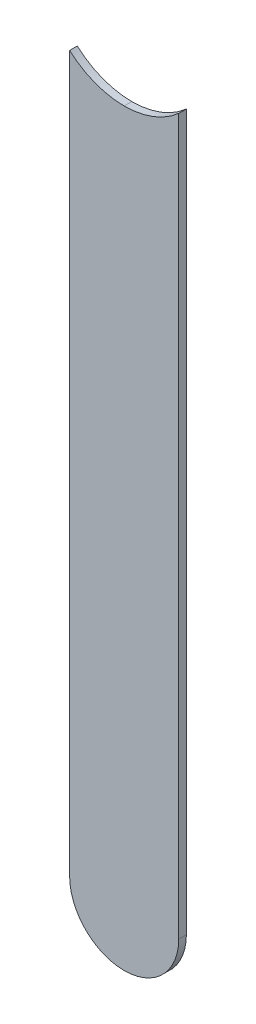
ISO-10303-21;
HEADER;
FILE_DESCRIPTION(('STEP AP214'),'2;1');
FILE_NAME('part.step','',(''),(''),'','','');
FILE_SCHEMA(('AUTOMOTIVE_DESIGN { 1 0 10303 214 1 1 1 1 }'));
ENDSEC;
DATA;
#1=APPLICATION_CONTEXT('core data for automotive mechanical design processes');
#2=APPLICATION_PROTOCOL_DEFINITION('international standard','automotive_design',2000,#1);
#3=PRODUCT_CONTEXT('',#1,'mechanical');
#4=PRODUCT('Part','Part','',(#3));
#5=PRODUCT_RELATED_PRODUCT_CATEGORY('part','',(#4));
#6=PRODUCT_DEFINITION_FORMATION('','',#4);
#7=PRODUCT_DEFINITION_CONTEXT('part definition',#1,'design');
#8=PRODUCT_DEFINITION('design','',#6,#7);
#9=PRODUCT_DEFINITION_SHAPE('','',#8);
#10=(LENGTH_UNIT() NAMED_UNIT(*) SI_UNIT(.MILLI.,.METRE.));
#11=(NAMED_UNIT(*) PLANE_ANGLE_UNIT() SI_UNIT($,.RADIAN.));
#12=(NAMED_UNIT(*) SI_UNIT($,.STERADIAN.) SOLID_ANGLE_UNIT());
#13=UNCERTAINTY_MEASURE_WITH_UNIT(LENGTH_MEASURE(1.E-05),#10,'distance_accuracy_value','');
#14=(GEOMETRIC_REPRESENTATION_CONTEXT(3) GLOBAL_UNCERTAINTY_ASSIGNED_CONTEXT((#13)) GLOBAL_UNIT_ASSIGNED_CONTEXT((#10,
#11,#12)) REPRESENTATION_CONTEXT('',''));
#15=CARTESIAN_POINT('',(0.,0.,0.));
#16=DIRECTION('',(0.,0.,1.));
#17=DIRECTION('',(1.,0.,0.));
#18=AXIS2_PLACEMENT_3D('',#15,#16,#17);
#19=CARTESIAN_POINT('',(157.73,-107.188,-0.035));
#20=DIRECTION('',(-1.,0.,0.));
#21=DIRECTION('',(0.,0.,1.));
#22=AXIS2_PLACEMENT_3D('',#19,#20,#21);
#23=PLANE('',#22);
#24=DIRECTION('',(0.,0.,-1.));
#25=VECTOR('',#24,1.);
#26=CARTESIAN_POINT('',(157.73,-103.9115084971,-0.045));
#27=LINE('',#26,#25);
#28=CARTESIAN_POINT('',(157.73,-103.9115084971,0.));
#29=VERTEX_POINT('',#28);
#30=CARTESIAN_POINT('',(157.73,-103.9115084971,-0.035));
#31=VERTEX_POINT('',#30);
#32=EDGE_CURVE('E11',#29,#31,#27,.T.);
#33=ORIENTED_EDGE('',*,*,#32,.F.);
#34=DIRECTION('',(0.,1.,0.));
#35=VECTOR('',#34,1.);
#36=CARTESIAN_POINT('',(157.73,-107.188,0.));
#37=LINE('',#36,#35);
#38=CARTESIAN_POINT('',(157.73,-107.188,0.));
#39=VERTEX_POINT('',#38);
#40=EDGE_CURVE('E133',#39,#29,#37,.T.);
#41=ORIENTED_EDGE('',*,*,#40,.F.);
#42=DIRECTION('',(0.,0.,1.));
#43=VECTOR('',#42,1.);
#44=CARTESIAN_POINT('',(157.73,-107.188,-0.035));
#45=LINE('',#44,#43);
#46=CARTESIAN_POINT('',(157.73,-107.188,-0.035));
#47=VERTEX_POINT('',#46);
#48=EDGE_CURVE('E119',#47,#39,#45,.T.);
#49=ORIENTED_EDGE('',*,*,#48,.F.);
#50=DIRECTION('',(0.,1.,0.));
#51=VECTOR('',#50,1.);
#52=CARTESIAN_POINT('',(157.73,-107.188,-0.035));
#53=LINE('',#52,#51);
#54=EDGE_CURVE('E86',#47,#31,#53,.T.);
#55=ORIENTED_EDGE('',*,*,#54,.T.);
#56=EDGE_LOOP('',(#33,#41,#49,#55));
#57=FACE_BOUND('',#56,.T.);
#58=ADVANCED_FACE('F17',(#57),#23,.F.);
#59=CARTESIAN_POINT('',(157.48,-103.632,-0.045));
#60=DIRECTION('',(0.,0.,-1.));
#61=DIRECTION('',(0.,-1.,0.));
#62=AXIS2_PLACEMENT_3D('',#59,#60,#61);
#63=CYLINDRICAL_SURFACE('',#62,0.375);
#64=CARTESIAN_POINT('',(157.48,-103.632,-0.035));
#65=DIRECTION('',(0.,0.,-1.));
#66=DIRECTION('',(0.,-1.,0.));
#67=AXIS2_PLACEMENT_3D('',#64,#65,#66);
#68=CIRCLE('',#67,0.375);
#69=CARTESIAN_POINT('',(157.48,-104.007,-0.035));
#70=VERTEX_POINT('',#69);
#71=EDGE_CURVE('E101',#31,#70,#68,.T.);
#72=ORIENTED_EDGE('',*,*,#71,.T.);
#73=DIRECTION('',(0.,0.,1.));
#74=VECTOR('',#73,1.);
#75=CARTESIAN_POINT('',(157.48,-104.007,-0.045));
#76=LINE('',#75,#74);
#77=CARTESIAN_POINT('',(157.48,-104.007,0.));
#78=VERTEX_POINT('',#77);
#79=EDGE_CURVE('E26',#70,#78,#76,.T.);
#80=ORIENTED_EDGE('',*,*,#79,.T.);
#81=CARTESIAN_POINT('',(157.48,-103.632,0.));
#82=DIRECTION('',(0.,0.,-1.));
#83=DIRECTION('',(0.,-1.,0.));
#84=AXIS2_PLACEMENT_3D('',#81,#82,#83);
#85=CIRCLE('',#84,0.375);
#86=EDGE_CURVE('E130',#29,#78,#85,.T.);
#87=ORIENTED_EDGE('',*,*,#86,.F.);
#88=ORIENTED_EDGE('',*,*,#32,.T.);
#89=EDGE_LOOP('',(#72,#80,#87,#88));
#90=FACE_BOUND('',#89,.T.);
#91=ADVANCED_FACE('F19',(#90),#63,.F.);
#92=CARTESIAN_POINT('',(157.48,-103.632,-0.045));
#93=DIRECTION('',(0.,0.,-1.));
#94=DIRECTION('',(0.,-1.,0.));
#95=AXIS2_PLACEMENT_3D('',#92,#93,#94);
#96=CYLINDRICAL_SURFACE('',#95,0.375);
#97=ORIENTED_EDGE('',*,*,#79,.F.);
#98=CARTESIAN_POINT('',(157.48,-103.632,-0.035));
#99=DIRECTION('',(0.,0.,-1.));
#100=DIRECTION('',(0.,-1.,0.));
#101=AXIS2_PLACEMENT_3D('',#98,#99,#100);
#102=CIRCLE('',#101,0.375);
#103=CARTESIAN_POINT('',(157.23,-103.9115084971,-0.035));
#104=VERTEX_POINT('',#103);
#105=EDGE_CURVE('E91',#70,#104,#102,.T.);
#106=ORIENTED_EDGE('',*,*,#105,.T.);
#107=DIRECTION('',(0.,0.,-1.));
#108=VECTOR('',#107,1.);
#109=CARTESIAN_POINT('',(157.23,-103.9115084971,-0.045));
#110=LINE('',#109,#108);
#111=CARTESIAN_POINT('',(157.23,-103.9115084971,0.));
#112=VERTEX_POINT('',#111);
#113=EDGE_CURVE('E99',#112,#104,#110,.T.);
#114=ORIENTED_EDGE('',*,*,#113,.F.);
#115=CARTESIAN_POINT('',(157.48,-103.632,0.));
#116=DIRECTION('',(0.,0.,-1.));
#117=DIRECTION('',(0.,-1.,0.));
#118=AXIS2_PLACEMENT_3D('',#115,#116,#117);
#119=CIRCLE('',#118,0.375);
#120=EDGE_CURVE('E118',#78,#112,#119,.T.);
#121=ORIENTED_EDGE('',*,*,#120,.F.);
#122=EDGE_LOOP('',(#97,#106,#114,#121));
#123=FACE_BOUND('',#122,.T.);
#124=ADVANCED_FACE('F145',(#123),#96,.F.);
#125=CARTESIAN_POINT('',(157.23,-103.632,0.));
#126=DIRECTION('',(0.,0.,1.));
#127=DIRECTION('',(1.,0.,0.));
#128=AXIS2_PLACEMENT_3D('',#125,#126,#127);
#129=PLANE('',#128);
#130=ORIENTED_EDGE('',*,*,#120,.T.);
#131=DIRECTION('',(0.,-1.,0.));
#132=VECTOR('',#131,1.);
#133=CARTESIAN_POINT('',(157.23,-103.632,0.));
#134=LINE('',#133,#132);
#135=CARTESIAN_POINT('',(157.23,-107.188,0.));
#136=VERTEX_POINT('',#135);
#137=EDGE_CURVE('E108',#112,#136,#134,.T.);
#138=ORIENTED_EDGE('',*,*,#137,.T.);
#139=CARTESIAN_POINT('',(157.48,-107.188,0.));
#140=DIRECTION('',(0.,0.,1.));
#141=DIRECTION('',(-1.,0.,0.));
#142=AXIS2_PLACEMENT_3D('',#139,#140,#141);
#143=CIRCLE('',#142,0.25);
#144=EDGE_CURVE('E105',#136,#39,#143,.T.);
#145=ORIENTED_EDGE('',*,*,#144,.T.);
#146=ORIENTED_EDGE('',*,*,#40,.T.);
#147=ORIENTED_EDGE('',*,*,#86,.T.);
#148=EDGE_LOOP('',(#130,#138,#145,#146,#147));
#149=FACE_BOUND('',#148,.T.);
#150=ADVANCED_FACE('F142',(#149),#129,.T.);
#151=CARTESIAN_POINT('',(157.48,-107.188,-0.035));
#152=DIRECTION('',(0.,0.,-1.));
#153=DIRECTION('',(-1.,0.,0.));
#154=AXIS2_PLACEMENT_3D('',#151,#152,#153);
#155=CYLINDRICAL_SURFACE('',#154,0.25);
#156=CARTESIAN_POINT('',(157.48,-107.188,-0.035));
#157=DIRECTION('',(0.,0.,1.));
#158=DIRECTION('',(-1.,0.,0.));
#159=AXIS2_PLACEMENT_3D('',#156,#157,#158);
#160=CIRCLE('',#159,0.25);
#161=CARTESIAN_POINT('',(157.23,-107.188,-0.035));
#162=VERTEX_POINT('',#161);
#163=EDGE_CURVE('E79',#162,#47,#160,.T.);
#164=ORIENTED_EDGE('',*,*,#163,.T.);
#165=ORIENTED_EDGE('',*,*,#48,.T.);
#166=ORIENTED_EDGE('',*,*,#144,.F.);
#167=DIRECTION('',(0.,0.,1.));
#168=VECTOR('',#167,1.);
#169=CARTESIAN_POINT('',(157.23,-107.188,-0.035));
#170=LINE('',#169,#168);
#171=EDGE_CURVE('E97',#162,#136,#170,.T.);
#172=ORIENTED_EDGE('',*,*,#171,.F.);
#173=EDGE_LOOP('',(#164,#165,#166,#172));
#174=FACE_BOUND('',#173,.T.);
#175=ADVANCED_FACE('F103',(#174),#155,.T.);
#176=CARTESIAN_POINT('',(157.23,-103.632,-0.035));
#177=DIRECTION('',(0.,0.,1.));
#178=DIRECTION('',(1.,0.,0.));
#179=AXIS2_PLACEMENT_3D('',#176,#177,#178);
#180=PLANE('',#179);
#181=ORIENTED_EDGE('',*,*,#71,.F.);
#182=ORIENTED_EDGE('',*,*,#54,.F.);
#183=ORIENTED_EDGE('',*,*,#163,.F.);
#184=DIRECTION('',(0.,-1.,0.));
#185=VECTOR('',#184,1.);
#186=CARTESIAN_POINT('',(157.23,-103.632,-0.035));
#187=LINE('',#186,#185);
#188=EDGE_CURVE('E84',#104,#162,#187,.T.);
#189=ORIENTED_EDGE('',*,*,#188,.F.);
#190=ORIENTED_EDGE('',*,*,#105,.F.);
#191=EDGE_LOOP('',(#181,#182,#183,#189,#190));
#192=FACE_BOUND('',#191,.T.);
#193=ADVANCED_FACE('F82',(#192),#180,.F.);
#194=CARTESIAN_POINT('',(157.23,-103.632,-0.035));
#195=DIRECTION('',(1.,0.,0.));
#196=DIRECTION('',(0.,1.,0.));
#197=AXIS2_PLACEMENT_3D('',#194,#195,#196);
#198=PLANE('',#197);
#199=ORIENTED_EDGE('',*,*,#171,.T.);
#200=ORIENTED_EDGE('',*,*,#137,.F.);
#201=ORIENTED_EDGE('',*,*,#113,.T.);
#202=ORIENTED_EDGE('',*,*,#188,.T.);
#203=EDGE_LOOP('',(#199,#200,#201,#202));
#204=FACE_BOUND('',#203,.T.);
#205=ADVANCED_FACE('F95',(#204),#198,.F.);
#206=CLOSED_SHELL('',(#58,#91,#124,#150,#175,#193,#205));
#207=MANIFOLD_SOLID_BREP('B1',#206);
#208=ADVANCED_BREP_SHAPE_REPRESENTATION('',(#18,#207),#14);
#209=SHAPE_DEFINITION_REPRESENTATION(#9,#208);
ENDSEC;
END-ISO-10303-21;
